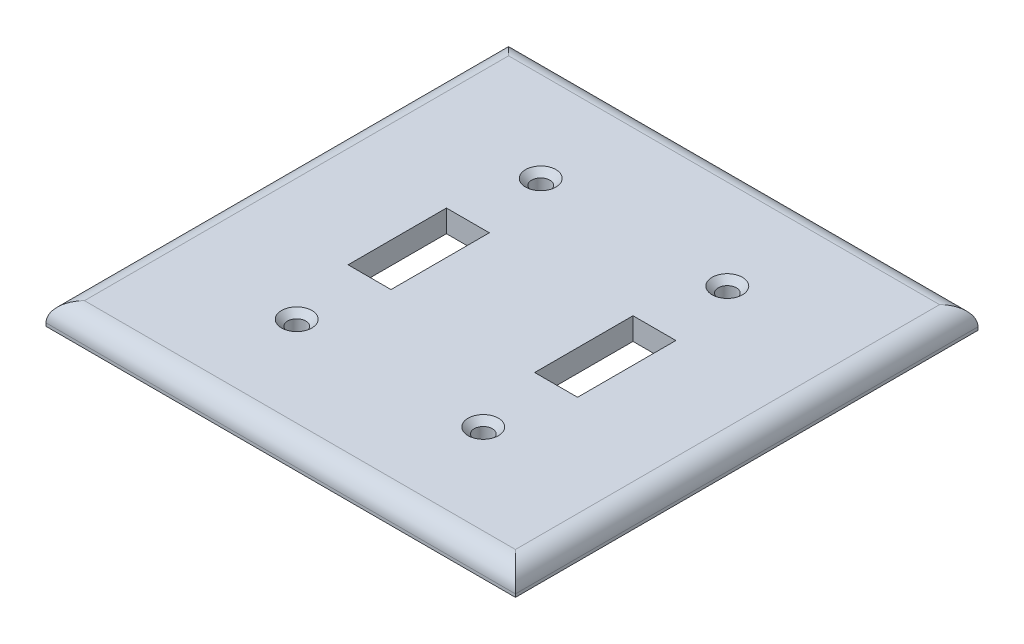
ISO-10303-21;
HEADER;
FILE_DESCRIPTION(('STEP AP214'),'2;1');
FILE_NAME('part.step','',(''),(''),'','','');
FILE_SCHEMA(('AUTOMOTIVE_DESIGN { 1 0 10303 214 1 1 1 1 }'));
ENDSEC;
DATA;
#1=APPLICATION_CONTEXT('core data for automotive mechanical design processes');
#2=APPLICATION_PROTOCOL_DEFINITION('international standard','automotive_design',2000,#1);
#3=PRODUCT_CONTEXT('',#1,'mechanical');
#4=PRODUCT('Part','Part','',(#3));
#5=PRODUCT_RELATED_PRODUCT_CATEGORY('part','',(#4));
#6=PRODUCT_DEFINITION_FORMATION('','',#4);
#7=PRODUCT_DEFINITION_CONTEXT('part definition',#1,'design');
#8=PRODUCT_DEFINITION('design','',#6,#7);
#9=PRODUCT_DEFINITION_SHAPE('','',#8);
#10=(LENGTH_UNIT() NAMED_UNIT(*) SI_UNIT(.MILLI.,.METRE.));
#11=(NAMED_UNIT(*) PLANE_ANGLE_UNIT() SI_UNIT($,.RADIAN.));
#12=(NAMED_UNIT(*) SI_UNIT($,.STERADIAN.) SOLID_ANGLE_UNIT());
#13=UNCERTAINTY_MEASURE_WITH_UNIT(LENGTH_MEASURE(1.E-05),#10,'distance_accuracy_value','');
#14=(GEOMETRIC_REPRESENTATION_CONTEXT(3) GLOBAL_UNCERTAINTY_ASSIGNED_CONTEXT((#13)) GLOBAL_UNIT_ASSIGNED_CONTEXT((#10,
#11,#12)) REPRESENTATION_CONTEXT('',''));
#15=CARTESIAN_POINT('',(0.,0.,0.));
#16=DIRECTION('',(0.,0.,1.));
#17=DIRECTION('',(1.,0.,0.));
#18=AXIS2_PLACEMENT_3D('',#15,#16,#17);
#19=CARTESIAN_POINT('',(0.,5.5,0.));
#20=DIRECTION('',(0.,1.,0.));
#21=DIRECTION('',(0.,0.,1.));
#22=AXIS2_PLACEMENT_3D('',#19,#20,#21);
#23=PLANE('',#22);
#24=CARTESIAN_POINT('',(20.0254052679415,5.5,35.9770644960488));
#25=DIRECTION('',(0.,1.,0.));
#26=DIRECTION('',(0.,0.,1.));
#27=AXIS2_PLACEMENT_3D('',#24,#25,#26);
#28=CIRCLE('',#27,3.75000000000004);
#29=CARTESIAN_POINT('',(20.0254052679415,5.5,39.7270644960489));
#30=VERTEX_POINT('',#29);
#31=EDGE_CURVE('E304',#30,#30,#28,.F.);
#32=ORIENTED_EDGE('',*,*,#31,.T.);
#33=EDGE_LOOP('',(#32));
#34=FACE_BOUND('',#33,.T.);
#35=CARTESIAN_POINT('',(-26.0745947320585,5.5,35.9770644960488));
#36=DIRECTION('',(0.,1.,0.));
#37=DIRECTION('',(0.,0.,1.));
#38=AXIS2_PLACEMENT_3D('',#35,#36,#37);
#39=CIRCLE('',#38,3.75000000000004);
#40=CARTESIAN_POINT('',(-26.0745947320585,5.5,39.7270644960489));
#41=VERTEX_POINT('',#40);
#42=EDGE_CURVE('E301',#41,#41,#39,.F.);
#43=ORIENTED_EDGE('',*,*,#42,.T.);
#44=EDGE_LOOP('',(#43));
#45=FACE_BOUND('',#44,.T.);
#46=CARTESIAN_POINT('',(20.0254052679415,5.5,-24.3229355039512));
#47=DIRECTION('',(0.,1.,0.));
#48=DIRECTION('',(0.,0.,1.));
#49=AXIS2_PLACEMENT_3D('',#46,#47,#48);
#50=CIRCLE('',#49,3.75);
#51=CARTESIAN_POINT('',(20.0254052679415,5.5,-20.5729355039512));
#52=VERTEX_POINT('',#51);
#53=EDGE_CURVE('E298',#52,#52,#50,.F.);
#54=ORIENTED_EDGE('',*,*,#53,.T.);
#55=EDGE_LOOP('',(#54));
#56=FACE_BOUND('',#55,.T.);
#57=CARTESIAN_POINT('',(-26.0745947320585,5.5,-24.3229355039512));
#58=DIRECTION('',(0.,1.,0.));
#59=DIRECTION('',(0.,0.,1.));
#60=AXIS2_PLACEMENT_3D('',#57,#58,#59);
#61=CIRCLE('',#60,3.75);
#62=CARTESIAN_POINT('',(-26.0745947320585,5.5,-20.5729355039512));
#63=VERTEX_POINT('',#62);
#64=EDGE_CURVE('E295',#63,#63,#61,.F.);
#65=ORIENTED_EDGE('',*,*,#64,.T.);
#66=EDGE_LOOP('',(#65));
#67=FACE_BOUND('',#66,.T.);
#68=DIRECTION('',(1.,0.,0.));
#69=VECTOR('',#68,1.);
#70=CARTESIAN_POINT('',(0.,5.5,-46.5729355039512));
#71=LINE('',#70,#69);
#72=CARTESIAN_POINT('',(50.2254052679415,5.5,-46.5729355039512));
#73=VERTEX_POINT('',#72);
#74=CARTESIAN_POINT('',(-56.2745947320585,5.5,-46.5729355039512));
#75=VERTEX_POINT('',#74);
#76=EDGE_CURVE('E260',#73,#75,#71,.F.);
#77=ORIENTED_EDGE('',*,*,#76,.T.);
#78=DIRECTION('',(0.,0.,1.));
#79=VECTOR('',#78,1.);
#80=CARTESIAN_POINT('',(-56.2745947320585,5.5,62.9770644960488));
#81=LINE('',#80,#79);
#82=CARTESIAN_POINT('',(-56.2745947320585,5.5,58.2270644960488));
#83=VERTEX_POINT('',#82);
#84=EDGE_CURVE('E273',#75,#83,#81,.T.);
#85=ORIENTED_EDGE('',*,*,#84,.T.);
#86=DIRECTION('',(1.,0.,0.));
#87=VECTOR('',#86,1.);
#88=CARTESIAN_POINT('',(54.9754052679415,5.5,58.2270644960488));
#89=LINE('',#88,#87);
#90=CARTESIAN_POINT('',(50.2254052679415,5.5,58.2270644960488));
#91=VERTEX_POINT('',#90);
#92=EDGE_CURVE('E271',#83,#91,#89,.T.);
#93=ORIENTED_EDGE('',*,*,#92,.T.);
#94=DIRECTION('',(0.,0.,1.));
#95=VECTOR('',#94,1.);
#96=CARTESIAN_POINT('',(50.2254052679415,5.5,0.));
#97=LINE('',#96,#95);
#98=EDGE_CURVE('E269',#91,#73,#97,.F.);
#99=ORIENTED_EDGE('',*,*,#98,.T.);
#100=EDGE_LOOP('',(#77,#85,#93,#99));
#101=FACE_BOUND('',#100,.T.);
#102=DIRECTION('',(0.,0.,1.));
#103=VECTOR('',#102,1.);
#104=CARTESIAN_POINT('',(14.7254052679415,5.5,0.));
#105=LINE('',#104,#103);
#106=CARTESIAN_POINT('',(14.7254052679415,5.5,-6.32293550395119));
#107=VERTEX_POINT('',#106);
#108=CARTESIAN_POINT('',(14.7254052679415,5.5,17.9770644960488));
#109=VERTEX_POINT('',#108);
#110=EDGE_CURVE('E204',#107,#109,#105,.T.);
#111=ORIENTED_EDGE('',*,*,#110,.F.);
#112=DIRECTION('',(1.,0.,0.));
#113=VECTOR('',#112,1.);
#114=CARTESIAN_POINT('',(0.,5.5,-6.32293550395119));
#115=LINE('',#114,#113);
#116=CARTESIAN_POINT('',(25.3254052679415,5.5,-6.32293550395119));
#117=VERTEX_POINT('',#116);
#118=EDGE_CURVE('E207',#107,#117,#115,.T.);
#119=ORIENTED_EDGE('',*,*,#118,.T.);
#120=DIRECTION('',(0.,0.,1.));
#121=VECTOR('',#120,1.);
#122=CARTESIAN_POINT('',(25.3254052679415,5.5,0.));
#123=LINE('',#122,#121);
#124=CARTESIAN_POINT('',(25.3254052679415,5.5,17.9770644960488));
#125=VERTEX_POINT('',#124);
#126=EDGE_CURVE('E211',#117,#125,#123,.T.);
#127=ORIENTED_EDGE('',*,*,#126,.T.);
#128=DIRECTION('',(1.,0.,0.));
#129=VECTOR('',#128,1.);
#130=CARTESIAN_POINT('',(0.,5.5,17.9770644960488));
#131=LINE('',#130,#129);
#132=EDGE_CURVE('E213',#109,#125,#131,.T.);
#133=ORIENTED_EDGE('',*,*,#132,.F.);
#134=EDGE_LOOP('',(#111,#119,#127,#133));
#135=FACE_BOUND('',#134,.T.);
#136=DIRECTION('',(0.,0.,1.));
#137=VECTOR('',#136,1.);
#138=CARTESIAN_POINT('',(-20.7745947320585,5.5,-6.32293550395119));
#139=LINE('',#138,#137);
#140=CARTESIAN_POINT('',(-20.7745947320585,5.5,-6.32293550395119));
#141=VERTEX_POINT('',#140);
#142=CARTESIAN_POINT('',(-20.7745947320585,5.5,17.9770644960488));
#143=VERTEX_POINT('',#142);
#144=EDGE_CURVE('E172',#141,#143,#139,.T.);
#145=ORIENTED_EDGE('',*,*,#144,.T.);
#146=DIRECTION('',(1.,0.,0.));
#147=VECTOR('',#146,1.);
#148=CARTESIAN_POINT('',(-31.3745947320585,5.5,17.9770644960488));
#149=LINE('',#148,#147);
#150=CARTESIAN_POINT('',(-31.3745947320585,5.5,17.9770644960488));
#151=VERTEX_POINT('',#150);
#152=EDGE_CURVE('E162',#151,#143,#149,.T.);
#153=ORIENTED_EDGE('',*,*,#152,.F.);
#154=DIRECTION('',(0.,0.,1.));
#155=VECTOR('',#154,1.);
#156=CARTESIAN_POINT('',(-31.3745947320585,5.5,-6.32293550395119));
#157=LINE('',#156,#155);
#158=CARTESIAN_POINT('',(-31.3745947320585,5.5,-6.32293550395119));
#159=VERTEX_POINT('',#158);
#160=EDGE_CURVE('E187',#159,#151,#157,.T.);
#161=ORIENTED_EDGE('',*,*,#160,.F.);
#162=DIRECTION('',(1.,0.,0.));
#163=VECTOR('',#162,1.);
#164=CARTESIAN_POINT('',(-31.3745947320585,5.5,-6.32293550395119));
#165=LINE('',#164,#163);
#166=EDGE_CURVE('E185',#159,#141,#165,.T.);
#167=ORIENTED_EDGE('',*,*,#166,.T.);
#168=EDGE_LOOP('',(#145,#153,#161,#167));
#169=FACE_BOUND('',#168,.T.);
#170=ADVANCED_FACE('F60',(#34,#45,#56,#67,#101,#135,#169),#23,.T.);
#171=CARTESIAN_POINT('',(0.,0.,0.));
#172=DIRECTION('',(0.,1.,0.));
#173=DIRECTION('',(0.,0.,1.));
#174=AXIS2_PLACEMENT_3D('',#171,#172,#173);
#175=PLANE('',#174);
#176=DIRECTION('',(0.,0.,1.));
#177=VECTOR('',#176,1.);
#178=CARTESIAN_POINT('',(54.9754052679415,0.,0.));
#179=LINE('',#178,#177);
#180=CARTESIAN_POINT('',(54.9754052679415,0.,-51.3229355039512));
#181=VERTEX_POINT('',#180);
#182=CARTESIAN_POINT('',(54.9754052679415,0.,62.9770644960488));
#183=VERTEX_POINT('',#182);
#184=EDGE_CURVE('E240',#181,#183,#179,.T.);
#185=ORIENTED_EDGE('',*,*,#184,.T.);
#186=DIRECTION('',(1.,0.,0.));
#187=VECTOR('',#186,1.);
#188=CARTESIAN_POINT('',(0.,0.,62.9770644960488));
#189=LINE('',#188,#187);
#190=CARTESIAN_POINT('',(-61.0245947320585,0.,62.9770644960488));
#191=VERTEX_POINT('',#190);
#192=EDGE_CURVE('E208',#191,#183,#189,.T.);
#193=ORIENTED_EDGE('',*,*,#192,.F.);
#194=DIRECTION('',(0.,0.,1.));
#195=VECTOR('',#194,1.);
#196=CARTESIAN_POINT('',(-61.0245947320585,0.,0.));
#197=LINE('',#196,#195);
#198=CARTESIAN_POINT('',(-61.0245947320585,0.,-51.3229355039512));
#199=VERTEX_POINT('',#198);
#200=EDGE_CURVE('E246',#199,#191,#197,.T.);
#201=ORIENTED_EDGE('',*,*,#200,.F.);
#202=DIRECTION('',(1.,0.,0.));
#203=VECTOR('',#202,1.);
#204=CARTESIAN_POINT('',(0.,0.,-51.3229355039512));
#205=LINE('',#204,#203);
#206=EDGE_CURVE('E243',#199,#181,#205,.T.);
#207=ORIENTED_EDGE('',*,*,#206,.T.);
#208=EDGE_LOOP('',(#185,#193,#201,#207));
#209=FACE_BOUND('',#208,.T.);
#210=DIRECTION('',(0.,0.,1.));
#211=VECTOR('',#210,1.);
#212=CARTESIAN_POINT('',(14.7254052679415,0.,0.));
#213=LINE('',#212,#211);
#214=CARTESIAN_POINT('',(14.7254052679415,0.,-6.32293550395119));
#215=VERTEX_POINT('',#214);
#216=CARTESIAN_POINT('',(14.7254052679415,0.,17.9770644960488));
#217=VERTEX_POINT('',#216);
#218=EDGE_CURVE('E228',#215,#217,#213,.T.);
#219=ORIENTED_EDGE('',*,*,#218,.T.);
#220=DIRECTION('',(1.,0.,0.));
#221=VECTOR('',#220,1.);
#222=CARTESIAN_POINT('',(0.,0.,17.9770644960488));
#223=LINE('',#222,#221);
#224=CARTESIAN_POINT('',(25.3254052679415,0.,17.9770644960488));
#225=VERTEX_POINT('',#224);
#226=EDGE_CURVE('E237',#217,#225,#223,.T.);
#227=ORIENTED_EDGE('',*,*,#226,.T.);
#228=DIRECTION('',(0.,0.,1.));
#229=VECTOR('',#228,1.);
#230=CARTESIAN_POINT('',(25.3254052679415,0.,0.));
#231=LINE('',#230,#229);
#232=CARTESIAN_POINT('',(25.3254052679415,0.,-6.32293550395119));
#233=VERTEX_POINT('',#232);
#234=EDGE_CURVE('E234',#233,#225,#231,.T.);
#235=ORIENTED_EDGE('',*,*,#234,.F.);
#236=DIRECTION('',(1.,0.,0.));
#237=VECTOR('',#236,1.);
#238=CARTESIAN_POINT('',(0.,0.,-6.32293550395119));
#239=LINE('',#238,#237);
#240=EDGE_CURVE('E231',#215,#233,#239,.T.);
#241=ORIENTED_EDGE('',*,*,#240,.F.);
#242=EDGE_LOOP('',(#219,#227,#235,#241));
#243=FACE_BOUND('',#242,.T.);
#244=CARTESIAN_POINT('',(-26.0745947320585,0.,-24.3229355039512));
#245=DIRECTION('',(0.,1.,0.));
#246=DIRECTION('',(0.,0.,1.));
#247=AXIS2_PLACEMENT_3D('',#244,#245,#246);
#248=CIRCLE('',#247,2.25);
#249=CARTESIAN_POINT('',(-26.0745947320585,0.,-22.0729355039512));
#250=VERTEX_POINT('',#249);
#251=EDGE_CURVE('E225',#250,#250,#248,.T.);
#252=ORIENTED_EDGE('',*,*,#251,.T.);
#253=EDGE_LOOP('',(#252));
#254=FACE_BOUND('',#253,.T.);
#255=CARTESIAN_POINT('',(-26.0745947320585,0.,35.9770644960488));
#256=DIRECTION('',(0.,1.,0.));
#257=DIRECTION('',(0.,0.,1.));
#258=AXIS2_PLACEMENT_3D('',#255,#256,#257);
#259=CIRCLE('',#258,2.25);
#260=CARTESIAN_POINT('',(-26.0745947320585,0.,38.2270644960488));
#261=VERTEX_POINT('',#260);
#262=EDGE_CURVE('E222',#261,#261,#259,.T.);
#263=ORIENTED_EDGE('',*,*,#262,.T.);
#264=EDGE_LOOP('',(#263));
#265=FACE_BOUND('',#264,.T.);
#266=CARTESIAN_POINT('',(20.0254052679415,0.,35.9770644960488));
#267=DIRECTION('',(0.,1.,0.));
#268=DIRECTION('',(0.,0.,1.));
#269=AXIS2_PLACEMENT_3D('',#266,#267,#268);
#270=CIRCLE('',#269,2.25);
#271=CARTESIAN_POINT('',(20.0254052679415,0.,38.2270644960488));
#272=VERTEX_POINT('',#271);
#273=EDGE_CURVE('E219',#272,#272,#270,.T.);
#274=ORIENTED_EDGE('',*,*,#273,.T.);
#275=EDGE_LOOP('',(#274));
#276=FACE_BOUND('',#275,.T.);
#277=CARTESIAN_POINT('',(20.0254052679415,0.,-24.3229355039512));
#278=DIRECTION('',(0.,1.,0.));
#279=DIRECTION('',(0.,0.,1.));
#280=AXIS2_PLACEMENT_3D('',#277,#278,#279);
#281=CIRCLE('',#280,2.25);
#282=CARTESIAN_POINT('',(20.0254052679415,0.,-22.0729355039512));
#283=VERTEX_POINT('',#282);
#284=EDGE_CURVE('E182',#283,#283,#281,.T.);
#285=ORIENTED_EDGE('',*,*,#284,.T.);
#286=EDGE_LOOP('',(#285));
#287=FACE_BOUND('',#286,.T.);
#288=DIRECTION('',(1.,0.,0.));
#289=VECTOR('',#288,1.);
#290=CARTESIAN_POINT('',(-31.3745947320585,0.,17.9770644960488));
#291=LINE('',#290,#289);
#292=CARTESIAN_POINT('',(-31.3745947320585,0.,17.9770644960488));
#293=VERTEX_POINT('',#292);
#294=CARTESIAN_POINT('',(-20.7745947320585,0.,17.9770644960488));
#295=VERTEX_POINT('',#294);
#296=EDGE_CURVE('E191',#293,#295,#291,.T.);
#297=ORIENTED_EDGE('',*,*,#296,.T.);
#298=DIRECTION('',(0.,0.,1.));
#299=VECTOR('',#298,1.);
#300=CARTESIAN_POINT('',(-20.7745947320585,0.,-6.32293550395119));
#301=LINE('',#300,#299);
#302=CARTESIAN_POINT('',(-20.7745947320585,0.,-6.32293550395119));
#303=VERTEX_POINT('',#302);
#304=EDGE_CURVE('E180',#303,#295,#301,.T.);
#305=ORIENTED_EDGE('',*,*,#304,.F.);
#306=DIRECTION('',(1.,0.,0.));
#307=VECTOR('',#306,1.);
#308=CARTESIAN_POINT('',(-31.3745947320585,0.,-6.32293550395119));
#309=LINE('',#308,#307);
#310=CARTESIAN_POINT('',(-31.3745947320585,0.,-6.32293550395119));
#311=VERTEX_POINT('',#310);
#312=EDGE_CURVE('E195',#311,#303,#309,.T.);
#313=ORIENTED_EDGE('',*,*,#312,.F.);
#314=DIRECTION('',(0.,0.,1.));
#315=VECTOR('',#314,1.);
#316=CARTESIAN_POINT('',(-31.3745947320585,0.,-6.32293550395119));
#317=LINE('',#316,#315);
#318=EDGE_CURVE('E173',#311,#293,#317,.T.);
#319=ORIENTED_EDGE('',*,*,#318,.T.);
#320=EDGE_LOOP('',(#297,#305,#313,#319));
#321=FACE_BOUND('',#320,.T.);
#322=ADVANCED_FACE('F329',(#209,#243,#254,#265,#276,#287,#321),#175,.F.);
#323=CARTESIAN_POINT('',(54.9754052679415,5.5,0.));
#324=DIRECTION('',(1.,0.,0.));
#325=DIRECTION('',(0.,0.,-1.));
#326=AXIS2_PLACEMENT_3D('',#323,#324,#325);
#327=PLANE('',#326);
#328=DIRECTION('',(0.,-1.,0.));
#329=VECTOR('',#328,1.);
#330=CARTESIAN_POINT('',(54.9754052679415,5.5,-51.3229355039512));
#331=LINE('',#330,#329);
#332=CARTESIAN_POINT('',(54.9754052679415,0.75,-51.3229355039512));
#333=VERTEX_POINT('',#332);
#334=EDGE_CURVE('E258',#333,#181,#331,.T.);
#335=ORIENTED_EDGE('',*,*,#334,.F.);
#336=DIRECTION('',(0.,0.,1.));
#337=VECTOR('',#336,1.);
#338=CARTESIAN_POINT('',(54.9754052679415,0.75,0.));
#339=LINE('',#338,#337);
#340=CARTESIAN_POINT('',(54.9754052679415,0.75,62.9770644960488));
#341=VERTEX_POINT('',#340);
#342=EDGE_CURVE('E82',#333,#341,#339,.T.);
#343=ORIENTED_EDGE('',*,*,#342,.T.);
#344=DIRECTION('',(0.,-1.,0.));
#345=VECTOR('',#344,1.);
#346=CARTESIAN_POINT('',(54.9754052679415,5.5,62.9770644960488));
#347=LINE('',#346,#345);
#348=EDGE_CURVE('E251',#341,#183,#347,.T.);
#349=ORIENTED_EDGE('',*,*,#348,.T.);
#350=ORIENTED_EDGE('',*,*,#184,.F.);
#351=EDGE_LOOP('',(#335,#343,#349,#350));
#352=FACE_BOUND('',#351,.T.);
#353=ADVANCED_FACE('F335',(#352),#327,.T.);
#354=CARTESIAN_POINT('',(0.,5.5,-51.3229355039512));
#355=DIRECTION('',(0.,0.,-1.));
#356=DIRECTION('',(-1.,0.,0.));
#357=AXIS2_PLACEMENT_3D('',#354,#355,#356);
#358=PLANE('',#357);
#359=DIRECTION('',(0.,-1.,0.));
#360=VECTOR('',#359,1.);
#361=CARTESIAN_POINT('',(-61.0245947320585,5.5,-51.3229355039512));
#362=LINE('',#361,#360);
#363=CARTESIAN_POINT('',(-61.0245947320585,0.75,-51.3229355039512));
#364=VERTEX_POINT('',#363);
#365=EDGE_CURVE('E256',#364,#199,#362,.T.);
#366=ORIENTED_EDGE('',*,*,#365,.F.);
#367=DIRECTION('',(1.,0.,0.));
#368=VECTOR('',#367,1.);
#369=CARTESIAN_POINT('',(0.,0.75,-51.3229355039512));
#370=LINE('',#369,#368);
#371=EDGE_CURVE('E75',#364,#333,#370,.T.);
#372=ORIENTED_EDGE('',*,*,#371,.T.);
#373=ORIENTED_EDGE('',*,*,#334,.T.);
#374=ORIENTED_EDGE('',*,*,#206,.F.);
#375=EDGE_LOOP('',(#366,#372,#373,#374));
#376=FACE_BOUND('',#375,.T.);
#377=ADVANCED_FACE('F350',(#376),#358,.T.);
#378=CARTESIAN_POINT('',(-61.0245947320585,5.5,0.));
#379=DIRECTION('',(1.,0.,0.));
#380=DIRECTION('',(0.,0.,-1.));
#381=AXIS2_PLACEMENT_3D('',#378,#379,#380);
#382=PLANE('',#381);
#383=DIRECTION('',(0.,-1.,0.));
#384=VECTOR('',#383,1.);
#385=CARTESIAN_POINT('',(-61.0245947320585,5.5,62.9770644960488));
#386=LINE('',#385,#384);
#387=CARTESIAN_POINT('',(-61.0245947320585,0.75,62.9770644960488));
#388=VERTEX_POINT('',#387);
#389=EDGE_CURVE('E253',#388,#191,#386,.T.);
#390=ORIENTED_EDGE('',*,*,#389,.F.);
#391=DIRECTION('',(0.,0.,1.));
#392=VECTOR('',#391,1.);
#393=CARTESIAN_POINT('',(-61.0245947320585,0.75,-51.3229355039512));
#394=LINE('',#393,#392);
#395=EDGE_CURVE('E276',#388,#364,#394,.F.);
#396=ORIENTED_EDGE('',*,*,#395,.T.);
#397=ORIENTED_EDGE('',*,*,#365,.T.);
#398=ORIENTED_EDGE('',*,*,#200,.T.);
#399=EDGE_LOOP('',(#390,#396,#397,#398));
#400=FACE_BOUND('',#399,.T.);
#401=ADVANCED_FACE('F346',(#400),#382,.F.);
#402=CARTESIAN_POINT('',(14.7254052679415,5.5,0.));
#403=DIRECTION('',(1.,0.,0.));
#404=DIRECTION('',(0.,0.,-1.));
#405=AXIS2_PLACEMENT_3D('',#402,#403,#404);
#406=PLANE('',#405);
#407=ORIENTED_EDGE('',*,*,#218,.F.);
#408=DIRECTION('',(0.,-1.,0.));
#409=VECTOR('',#408,1.);
#410=CARTESIAN_POINT('',(14.7254052679415,5.5,-6.32293550395119));
#411=LINE('',#410,#409);
#412=EDGE_CURVE('E254',#107,#215,#411,.T.);
#413=ORIENTED_EDGE('',*,*,#412,.F.);
#414=ORIENTED_EDGE('',*,*,#110,.T.);
#415=DIRECTION('',(0.,-1.,0.));
#416=VECTOR('',#415,1.);
#417=CARTESIAN_POINT('',(14.7254052679415,5.5,17.9770644960488));
#418=LINE('',#417,#416);
#419=EDGE_CURVE('E216',#109,#217,#418,.T.);
#420=ORIENTED_EDGE('',*,*,#419,.T.);
#421=EDGE_LOOP('',(#407,#413,#414,#420));
#422=FACE_BOUND('',#421,.T.);
#423=ADVANCED_FACE('F349',(#422),#406,.T.);
#424=CARTESIAN_POINT('',(0.,5.5,-6.32293550395119));
#425=DIRECTION('',(0.,0.,-1.));
#426=DIRECTION('',(-1.,0.,0.));
#427=AXIS2_PLACEMENT_3D('',#424,#425,#426);
#428=PLANE('',#427);
#429=ORIENTED_EDGE('',*,*,#240,.T.);
#430=DIRECTION('',(0.,-1.,0.));
#431=VECTOR('',#430,1.);
#432=CARTESIAN_POINT('',(25.3254052679415,5.5,-6.32293550395119));
#433=LINE('',#432,#431);
#434=EDGE_CURVE('E264',#117,#233,#433,.T.);
#435=ORIENTED_EDGE('',*,*,#434,.F.);
#436=ORIENTED_EDGE('',*,*,#118,.F.);
#437=ORIENTED_EDGE('',*,*,#412,.T.);
#438=EDGE_LOOP('',(#429,#435,#436,#437));
#439=FACE_BOUND('',#438,.T.);
#440=ADVANCED_FACE('F364',(#439),#428,.F.);
#441=CARTESIAN_POINT('',(25.3254052679415,5.5,0.));
#442=DIRECTION('',(1.,0.,0.));
#443=DIRECTION('',(0.,0.,-1.));
#444=AXIS2_PLACEMENT_3D('',#441,#442,#443);
#445=PLANE('',#444);
#446=ORIENTED_EDGE('',*,*,#234,.T.);
#447=DIRECTION('',(0.,-1.,0.));
#448=VECTOR('',#447,1.);
#449=CARTESIAN_POINT('',(25.3254052679415,5.5,17.9770644960488));
#450=LINE('',#449,#448);
#451=EDGE_CURVE('E262',#125,#225,#450,.T.);
#452=ORIENTED_EDGE('',*,*,#451,.F.);
#453=ORIENTED_EDGE('',*,*,#126,.F.);
#454=ORIENTED_EDGE('',*,*,#434,.T.);
#455=EDGE_LOOP('',(#446,#452,#453,#454));
#456=FACE_BOUND('',#455,.T.);
#457=ADVANCED_FACE('F360',(#456),#445,.F.);
#458=CARTESIAN_POINT('',(0.,5.5,17.9770644960488));
#459=DIRECTION('',(0.,0.,-1.));
#460=DIRECTION('',(-1.,0.,0.));
#461=AXIS2_PLACEMENT_3D('',#458,#459,#460);
#462=PLANE('',#461);
#463=ORIENTED_EDGE('',*,*,#226,.F.);
#464=ORIENTED_EDGE('',*,*,#419,.F.);
#465=ORIENTED_EDGE('',*,*,#132,.T.);
#466=ORIENTED_EDGE('',*,*,#451,.T.);
#467=EDGE_LOOP('',(#463,#464,#465,#466));
#468=FACE_BOUND('',#467,.T.);
#469=ADVANCED_FACE('F356',(#468),#462,.T.);
#470=CARTESIAN_POINT('',(-26.0745947320585,5.5,-24.3229355039512));
#471=DIRECTION('',(0.,-1.,0.));
#472=DIRECTION('',(0.,0.,-1.));
#473=AXIS2_PLACEMENT_3D('',#470,#471,#472);
#474=CYLINDRICAL_SURFACE('',#473,2.25);
#475=CARTESIAN_POINT('',(-26.0745947320585,4.,-24.3229355039512));
#476=DIRECTION('',(0.,1.,0.));
#477=DIRECTION('',(0.,0.,1.));
#478=AXIS2_PLACEMENT_3D('',#475,#476,#477);
#479=CIRCLE('',#478,2.25);
#480=CARTESIAN_POINT('',(-26.0745947320585,4.,-22.0729355039512));
#481=VERTEX_POINT('',#480);
#482=EDGE_CURVE('E12',#481,#481,#479,.T.);
#483=ORIENTED_EDGE('',*,*,#482,.T.);
#484=EDGE_LOOP('',(#483));
#485=FACE_BOUND('',#484,.T.);
#486=ORIENTED_EDGE('',*,*,#251,.F.);
#487=EDGE_LOOP('',(#486));
#488=FACE_BOUND('',#487,.T.);
#489=ADVANCED_FACE('F359',(#485,#488),#474,.F.);
#490=CARTESIAN_POINT('',(-26.0745947320585,5.5,35.9770644960488));
#491=DIRECTION('',(0.,-1.,0.));
#492=DIRECTION('',(0.,0.,-1.));
#493=AXIS2_PLACEMENT_3D('',#490,#491,#492);
#494=CYLINDRICAL_SURFACE('',#493,2.25);
#495=CARTESIAN_POINT('',(-26.0745947320585,3.99999999999996,35.9770644960488));
#496=DIRECTION('',(0.,1.,0.));
#497=DIRECTION('',(0.,0.,1.));
#498=AXIS2_PLACEMENT_3D('',#495,#496,#497);
#499=CIRCLE('',#498,2.25);
#500=CARTESIAN_POINT('',(-26.0745947320585,3.99999999999996,38.2270644960488));
#501=VERTEX_POINT('',#500);
#502=EDGE_CURVE('E307',#501,#501,#499,.T.);
#503=ORIENTED_EDGE('',*,*,#502,.T.);
#504=EDGE_LOOP('',(#503));
#505=FACE_BOUND('',#504,.T.);
#506=ORIENTED_EDGE('',*,*,#262,.F.);
#507=EDGE_LOOP('',(#506));
#508=FACE_BOUND('',#507,.T.);
#509=ADVANCED_FACE('F374',(#505,#508),#494,.F.);
#510=CARTESIAN_POINT('',(20.0254052679415,5.5,35.9770644960488));
#511=DIRECTION('',(0.,-1.,0.));
#512=DIRECTION('',(0.,0.,-1.));
#513=AXIS2_PLACEMENT_3D('',#510,#511,#512);
#514=CYLINDRICAL_SURFACE('',#513,2.25);
#515=CARTESIAN_POINT('',(20.0254052679415,3.99999999999996,35.9770644960488));
#516=DIRECTION('',(0.,1.,0.));
#517=DIRECTION('',(0.,0.,1.));
#518=AXIS2_PLACEMENT_3D('',#515,#516,#517);
#519=CIRCLE('',#518,2.25);
#520=CARTESIAN_POINT('',(20.0254052679415,3.99999999999996,38.2270644960488));
#521=VERTEX_POINT('',#520);
#522=EDGE_CURVE('E283',#521,#521,#519,.T.);
#523=ORIENTED_EDGE('',*,*,#522,.T.);
#524=EDGE_LOOP('',(#523));
#525=FACE_BOUND('',#524,.T.);
#526=ORIENTED_EDGE('',*,*,#273,.F.);
#527=EDGE_LOOP('',(#526));
#528=FACE_BOUND('',#527,.T.);
#529=ADVANCED_FACE('F378',(#525,#528),#514,.F.);
#530=CARTESIAN_POINT('',(20.0254052679415,5.5,-24.3229355039512));
#531=DIRECTION('',(0.,-1.,0.));
#532=DIRECTION('',(0.,0.,-1.));
#533=AXIS2_PLACEMENT_3D('',#530,#531,#532);
#534=CYLINDRICAL_SURFACE('',#533,2.25);
#535=CARTESIAN_POINT('',(20.0254052679415,4.,-24.3229355039512));
#536=DIRECTION('',(0.,1.,0.));
#537=DIRECTION('',(0.,0.,1.));
#538=AXIS2_PLACEMENT_3D('',#535,#536,#537);
#539=CIRCLE('',#538,2.25);
#540=CARTESIAN_POINT('',(20.0254052679415,4.,-22.0729355039512));
#541=VERTEX_POINT('',#540);
#542=EDGE_CURVE('E68',#541,#541,#539,.T.);
#543=ORIENTED_EDGE('',*,*,#542,.T.);
#544=EDGE_LOOP('',(#543));
#545=FACE_BOUND('',#544,.T.);
#546=ORIENTED_EDGE('',*,*,#284,.F.);
#547=EDGE_LOOP('',(#546));
#548=FACE_BOUND('',#547,.T.);
#549=ADVANCED_FACE('F312',(#545,#548),#534,.F.);
#550=CARTESIAN_POINT('',(0.,5.5,62.9770644960488));
#551=DIRECTION('',(0.,0.,-1.));
#552=DIRECTION('',(-1.,0.,0.));
#553=AXIS2_PLACEMENT_3D('',#550,#551,#552);
#554=PLANE('',#553);
#555=ORIENTED_EDGE('',*,*,#348,.F.);
#556=DIRECTION('',(1.,0.,0.));
#557=VECTOR('',#556,1.);
#558=CARTESIAN_POINT('',(-61.0245947320585,0.75,62.9770644960488));
#559=LINE('',#558,#557);
#560=EDGE_CURVE('E279',#341,#388,#559,.F.);
#561=ORIENTED_EDGE('',*,*,#560,.T.);
#562=ORIENTED_EDGE('',*,*,#389,.T.);
#563=ORIENTED_EDGE('',*,*,#192,.T.);
#564=EDGE_LOOP('',(#555,#561,#562,#563));
#565=FACE_BOUND('',#564,.T.);
#566=ADVANCED_FACE('F342',(#565),#554,.F.);
#567=CARTESIAN_POINT('',(-31.3745947320585,5.5,17.9770644960488));
#568=DIRECTION('',(0.,0.,-1.));
#569=DIRECTION('',(-1.,0.,0.));
#570=AXIS2_PLACEMENT_3D('',#567,#568,#569);
#571=PLANE('',#570);
#572=ORIENTED_EDGE('',*,*,#296,.F.);
#573=DIRECTION('',(0.,-1.,0.));
#574=VECTOR('',#573,1.);
#575=CARTESIAN_POINT('',(-31.3745947320585,5.5,17.9770644960488));
#576=LINE('',#575,#574);
#577=EDGE_CURVE('E168',#151,#293,#576,.T.);
#578=ORIENTED_EDGE('',*,*,#577,.F.);
#579=ORIENTED_EDGE('',*,*,#152,.T.);
#580=DIRECTION('',(0.,-1.,0.));
#581=VECTOR('',#580,1.);
#582=CARTESIAN_POINT('',(-20.7745947320585,5.5,17.9770644960488));
#583=LINE('',#582,#581);
#584=EDGE_CURVE('E165',#143,#295,#583,.T.);
#585=ORIENTED_EDGE('',*,*,#584,.T.);
#586=EDGE_LOOP('',(#572,#578,#579,#585));
#587=FACE_BOUND('',#586,.T.);
#588=ADVANCED_FACE('F164',(#587),#571,.T.);
#589=CARTESIAN_POINT('',(-20.7745947320585,5.5,-6.32293550395119));
#590=DIRECTION('',(1.,0.,0.));
#591=DIRECTION('',(0.,0.,-1.));
#592=AXIS2_PLACEMENT_3D('',#589,#590,#591);
#593=PLANE('',#592);
#594=ORIENTED_EDGE('',*,*,#304,.T.);
#595=ORIENTED_EDGE('',*,*,#584,.F.);
#596=ORIENTED_EDGE('',*,*,#144,.F.);
#597=DIRECTION('',(0.,-1.,0.));
#598=VECTOR('',#597,1.);
#599=CARTESIAN_POINT('',(-20.7745947320585,5.5,-6.32293550395119));
#600=LINE('',#599,#598);
#601=EDGE_CURVE('E183',#141,#303,#600,.T.);
#602=ORIENTED_EDGE('',*,*,#601,.T.);
#603=EDGE_LOOP('',(#594,#595,#596,#602));
#604=FACE_BOUND('',#603,.T.);
#605=ADVANCED_FACE('F177',(#604),#593,.F.);
#606=CARTESIAN_POINT('',(-31.3745947320585,5.5,-6.32293550395119));
#607=DIRECTION('',(0.,0.,-1.));
#608=DIRECTION('',(-1.,0.,0.));
#609=AXIS2_PLACEMENT_3D('',#606,#607,#608);
#610=PLANE('',#609);
#611=ORIENTED_EDGE('',*,*,#312,.T.);
#612=ORIENTED_EDGE('',*,*,#601,.F.);
#613=ORIENTED_EDGE('',*,*,#166,.F.);
#614=DIRECTION('',(0.,-1.,0.));
#615=VECTOR('',#614,1.);
#616=CARTESIAN_POINT('',(-31.3745947320585,5.5,-6.32293550395119));
#617=LINE('',#616,#615);
#618=EDGE_CURVE('E201',#159,#311,#617,.T.);
#619=ORIENTED_EDGE('',*,*,#618,.T.);
#620=EDGE_LOOP('',(#611,#612,#613,#619));
#621=FACE_BOUND('',#620,.T.);
#622=ADVANCED_FACE('F420',(#621),#610,.F.);
#623=CARTESIAN_POINT('',(-31.3745947320585,5.5,-6.32293550395119));
#624=DIRECTION('',(1.,0.,0.));
#625=DIRECTION('',(0.,0.,-1.));
#626=AXIS2_PLACEMENT_3D('',#623,#624,#625);
#627=PLANE('',#626);
#628=ORIENTED_EDGE('',*,*,#318,.F.);
#629=ORIENTED_EDGE('',*,*,#618,.F.);
#630=ORIENTED_EDGE('',*,*,#160,.T.);
#631=ORIENTED_EDGE('',*,*,#577,.T.);
#632=EDGE_LOOP('',(#628,#629,#630,#631));
#633=FACE_BOUND('',#632,.T.);
#634=ADVANCED_FACE('F400',(#633),#627,.T.);
#635=CARTESIAN_POINT('',(50.2254052679415,0.75,0.));
#636=DIRECTION('',(0.,0.,1.));
#637=DIRECTION('',(1.,0.,0.));
#638=AXIS2_PLACEMENT_3D('',#635,#636,#637);
#639=CYLINDRICAL_SURFACE('',#638,4.75);
#640=CARTESIAN_POINT('',(50.2254052679415,0.75,58.2270644960488));
#641=DIRECTION('',(-0.707106781186547,0.,0.707106781186548));
#642=DIRECTION('',(0.707106781186548,0.,0.707106781186547));
#643=AXIS2_PLACEMENT_3D('',#640,#641,#642);
#644=ELLIPSE('',#643,6.7175144212722,4.75);
#645=EDGE_CURVE('E288',#341,#91,#644,.T.);
#646=ORIENTED_EDGE('',*,*,#645,.F.);
#647=ORIENTED_EDGE('',*,*,#342,.F.);
#648=CARTESIAN_POINT('',(50.2254052679415,0.75,-46.5729355039512));
#649=DIRECTION('',(0.707106781186548,0.,0.707106781186547));
#650=DIRECTION('',(0.707106781186547,0.,-0.707106781186548));
#651=AXIS2_PLACEMENT_3D('',#648,#649,#650);
#652=ELLIPSE('',#651,6.7175144212722,4.75);
#653=EDGE_CURVE('E193',#73,#333,#652,.F.);
#654=ORIENTED_EDGE('',*,*,#653,.F.);
#655=ORIENTED_EDGE('',*,*,#98,.F.);
#656=EDGE_LOOP('',(#646,#647,#654,#655));
#657=FACE_BOUND('',#656,.T.);
#658=ADVANCED_FACE('F396',(#657),#639,.T.);
#659=CARTESIAN_POINT('',(0.,0.75,-46.5729355039512));
#660=DIRECTION('',(1.,0.,0.));
#661=DIRECTION('',(0.,0.,-1.));
#662=AXIS2_PLACEMENT_3D('',#659,#660,#661);
#663=CYLINDRICAL_SURFACE('',#662,4.75);
#664=ORIENTED_EDGE('',*,*,#653,.T.);
#665=ORIENTED_EDGE('',*,*,#371,.F.);
#666=CARTESIAN_POINT('',(-56.2745947320585,0.75,-46.5729355039512));
#667=DIRECTION('',(0.707106781186547,0.,-0.707106781186548));
#668=DIRECTION('',(0.707106781186548,0.,0.707106781186547));
#669=AXIS2_PLACEMENT_3D('',#666,#667,#668);
#670=ELLIPSE('',#669,6.7175144212722,4.75);
#671=EDGE_CURVE('E286',#75,#364,#670,.F.);
#672=ORIENTED_EDGE('',*,*,#671,.F.);
#673=ORIENTED_EDGE('',*,*,#76,.F.);
#674=EDGE_LOOP('',(#664,#665,#672,#673));
#675=FACE_BOUND('',#674,.T.);
#676=ADVANCED_FACE('F392',(#675),#663,.T.);
#677=CARTESIAN_POINT('',(0.,0.75,58.2270644960488));
#678=DIRECTION('',(-1.,0.,0.));
#679=DIRECTION('',(0.,0.,1.));
#680=AXIS2_PLACEMENT_3D('',#677,#678,#679);
#681=CYLINDRICAL_SURFACE('',#680,4.75);
#682=ORIENTED_EDGE('',*,*,#645,.T.);
#683=ORIENTED_EDGE('',*,*,#92,.F.);
#684=CARTESIAN_POINT('',(-56.2745947320585,0.75,58.2270644960488));
#685=DIRECTION('',(-0.707106781186548,0.,-0.707106781186547));
#686=DIRECTION('',(-0.707106781186547,0.,0.707106781186548));
#687=AXIS2_PLACEMENT_3D('',#684,#685,#686);
#688=ELLIPSE('',#687,6.7175144212722,4.75);
#689=EDGE_CURVE('E284',#388,#83,#688,.T.);
#690=ORIENTED_EDGE('',*,*,#689,.F.);
#691=ORIENTED_EDGE('',*,*,#560,.F.);
#692=EDGE_LOOP('',(#682,#683,#690,#691));
#693=FACE_BOUND('',#692,.T.);
#694=ADVANCED_FACE('F388',(#693),#681,.T.);
#695=CARTESIAN_POINT('',(-56.2745947320585,0.75,0.));
#696=DIRECTION('',(0.,0.,-1.));
#697=DIRECTION('',(-1.,0.,0.));
#698=AXIS2_PLACEMENT_3D('',#695,#696,#697);
#699=CYLINDRICAL_SURFACE('',#698,4.75);
#700=ORIENTED_EDGE('',*,*,#671,.T.);
#701=ORIENTED_EDGE('',*,*,#395,.F.);
#702=ORIENTED_EDGE('',*,*,#689,.T.);
#703=ORIENTED_EDGE('',*,*,#84,.F.);
#704=EDGE_LOOP('',(#700,#701,#702,#703));
#705=FACE_BOUND('',#704,.T.);
#706=ADVANCED_FACE('F385',(#705),#699,.T.);
#707=CARTESIAN_POINT('',(20.0254052679415,3.99999999999996,35.9770644960488));
#708=DIRECTION('',(0.,1.,0.));
#709=DIRECTION('',(0.,0.,1.));
#710=AXIS2_PLACEMENT_3D('',#707,#708,#709);
#711=CONICAL_SURFACE('',#710,2.25,0.78539816339745);
#712=ORIENTED_EDGE('',*,*,#31,.F.);
#713=EDGE_LOOP('',(#712));
#714=FACE_BOUND('',#713,.T.);
#715=ORIENTED_EDGE('',*,*,#522,.F.);
#716=EDGE_LOOP('',(#715));
#717=FACE_BOUND('',#716,.T.);
#718=ADVANCED_FACE('F324',(#714,#717),#711,.F.);
#719=CARTESIAN_POINT('',(-26.0745947320585,3.99999999999996,35.9770644960488));
#720=DIRECTION('',(0.,1.,0.));
#721=DIRECTION('',(0.,0.,1.));
#722=AXIS2_PLACEMENT_3D('',#719,#720,#721);
#723=CONICAL_SURFACE('',#722,2.25,0.78539816339745);
#724=ORIENTED_EDGE('',*,*,#42,.F.);
#725=EDGE_LOOP('',(#724));
#726=FACE_BOUND('',#725,.T.);
#727=ORIENTED_EDGE('',*,*,#502,.F.);
#728=EDGE_LOOP('',(#727));
#729=FACE_BOUND('',#728,.T.);
#730=ADVANCED_FACE('F317',(#726,#729),#723,.F.);
#731=CARTESIAN_POINT('',(20.0254052679415,4.,-24.3229355039512));
#732=DIRECTION('',(0.,1.,0.));
#733=DIRECTION('',(0.,0.,1.));
#734=AXIS2_PLACEMENT_3D('',#731,#732,#733);
#735=CONICAL_SURFACE('',#734,2.25,0.78539816339745);
#736=ORIENTED_EDGE('',*,*,#53,.F.);
#737=EDGE_LOOP('',(#736));
#738=FACE_BOUND('',#737,.T.);
#739=ORIENTED_EDGE('',*,*,#542,.F.);
#740=EDGE_LOOP('',(#739));
#741=FACE_BOUND('',#740,.T.);
#742=ADVANCED_FACE('F315',(#738,#741),#735,.F.);
#743=CARTESIAN_POINT('',(-26.0745947320585,4.,-24.3229355039512));
#744=DIRECTION('',(0.,1.,0.));
#745=DIRECTION('',(0.,0.,1.));
#746=AXIS2_PLACEMENT_3D('',#743,#744,#745);
#747=CONICAL_SURFACE('',#746,2.25,0.78539816339745);
#748=ORIENTED_EDGE('',*,*,#64,.F.);
#749=EDGE_LOOP('',(#748));
#750=FACE_BOUND('',#749,.T.);
#751=ORIENTED_EDGE('',*,*,#482,.F.);
#752=EDGE_LOOP('',(#751));
#753=FACE_BOUND('',#752,.T.);
#754=ADVANCED_FACE('F62',(#750,#753),#747,.F.);
#755=CLOSED_SHELL('',(#170,#322,#353,#377,#401,#423,#440,#457,#469,#489,#509,#529,#549,#566,
#588,#605,#622,#634,#658,#676,#694,#706,#718,#730,#742,#754));
#756=MANIFOLD_SOLID_BREP('B2',#755);
#757=ADVANCED_BREP_SHAPE_REPRESENTATION('',(#18,#756),#14);
#758=SHAPE_DEFINITION_REPRESENTATION(#9,#757);
ENDSEC;
END-ISO-10303-21;
